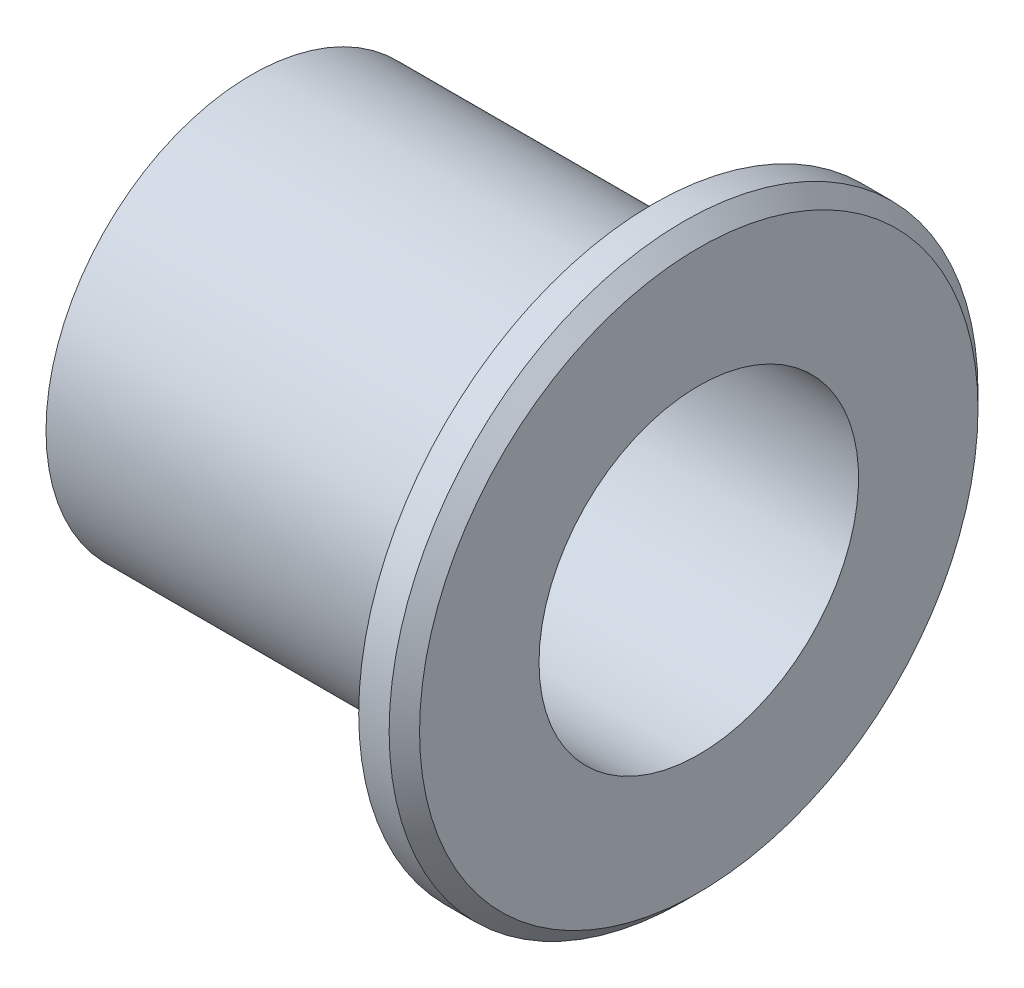
ISO-10303-21;
HEADER;
FILE_DESCRIPTION(('STEP AP214'),'2;1');
FILE_NAME('part.step','',(''),(''),'','','');
FILE_SCHEMA(('AUTOMOTIVE_DESIGN { 1 0 10303 214 1 1 1 1 }'));
ENDSEC;
DATA;
#1=APPLICATION_CONTEXT('core data for automotive mechanical design processes');
#2=APPLICATION_PROTOCOL_DEFINITION('international standard','automotive_design',2000,#1);
#3=PRODUCT_CONTEXT('',#1,'mechanical');
#4=PRODUCT('Part','Part','',(#3));
#5=PRODUCT_RELATED_PRODUCT_CATEGORY('part','',(#4));
#6=PRODUCT_DEFINITION_FORMATION('','',#4);
#7=PRODUCT_DEFINITION_CONTEXT('part definition',#1,'design');
#8=PRODUCT_DEFINITION('design','',#6,#7);
#9=PRODUCT_DEFINITION_SHAPE('','',#8);
#10=(LENGTH_UNIT() NAMED_UNIT(*) SI_UNIT(.MILLI.,.METRE.));
#11=(NAMED_UNIT(*) PLANE_ANGLE_UNIT() SI_UNIT($,.RADIAN.));
#12=(NAMED_UNIT(*) SI_UNIT($,.STERADIAN.) SOLID_ANGLE_UNIT());
#13=UNCERTAINTY_MEASURE_WITH_UNIT(LENGTH_MEASURE(1.E-05),#10,'distance_accuracy_value','');
#14=(GEOMETRIC_REPRESENTATION_CONTEXT(3) GLOBAL_UNCERTAINTY_ASSIGNED_CONTEXT((#13)) GLOBAL_UNIT_ASSIGNED_CONTEXT((#10,
#11,#12)) REPRESENTATION_CONTEXT('',''));
#15=CARTESIAN_POINT('',(0.,0.,0.));
#16=DIRECTION('',(0.,0.,1.));
#17=DIRECTION('',(1.,0.,0.));
#18=AXIS2_PLACEMENT_3D('',#15,#16,#17);
#19=CARTESIAN_POINT('',(0.,13.5,0.));
#20=DIRECTION('',(1.,0.,0.));
#21=DIRECTION('',(0.,0.,-1.));
#22=AXIS2_PLACEMENT_3D('',#19,#20,#21);
#23=PLANE('',#22);
#24=CARTESIAN_POINT('',(0.,7.,0.));
#25=DIRECTION('',(1.,0.,0.));
#26=DIRECTION('',(0.,0.,-1.));
#27=AXIS2_PLACEMENT_3D('',#24,#25,#26);
#28=CIRCLE('',#27,1.25);
#29=CARTESIAN_POINT('',(0.,7.,-1.25));
#30=VERTEX_POINT('',#29);
#31=EDGE_CURVE('E179',#30,#30,#28,.T.);
#32=ORIENTED_EDGE('',*,*,#31,.T.);
#33=EDGE_LOOP('',(#32));
#34=FACE_BOUND('',#33,.T.);
#35=CARTESIAN_POINT('',(0.,-7.,0.));
#36=DIRECTION('',(1.,0.,0.));
#37=DIRECTION('',(0.,0.,-1.));
#38=AXIS2_PLACEMENT_3D('',#35,#36,#37);
#39=CIRCLE('',#38,1.25);
#40=CARTESIAN_POINT('',(0.,-7.,-1.24999999999995));
#41=VERTEX_POINT('',#40);
#42=EDGE_CURVE('E119',#41,#41,#39,.T.);
#43=ORIENTED_EDGE('',*,*,#42,.T.);
#44=EDGE_LOOP('',(#43));
#45=FACE_BOUND('',#44,.T.);
#46=DIRECTION('',(0.,0.866025403784439,0.5));
#47=VECTOR('',#46,1.);
#48=CARTESIAN_POINT('',(0.,0.,-4.61880215351701));
#49=LINE('',#48,#47);
#50=CARTESIAN_POINT('',(0.,0.,-4.61880215351701));
#51=VERTEX_POINT('',#50);
#52=CARTESIAN_POINT('',(0.,4.,-2.3094010767585));
#53=VERTEX_POINT('',#52);
#54=EDGE_CURVE('E105',#51,#53,#49,.T.);
#55=ORIENTED_EDGE('',*,*,#54,.T.);
#56=DIRECTION('',(0.,0.,1.));
#57=VECTOR('',#56,1.);
#58=CARTESIAN_POINT('',(0.,4.,-2.3094010767585));
#59=LINE('',#58,#57);
#60=CARTESIAN_POINT('',(0.,4.,2.3094010767585));
#61=VERTEX_POINT('',#60);
#62=EDGE_CURVE('E99',#53,#61,#59,.T.);
#63=ORIENTED_EDGE('',*,*,#62,.T.);
#64=DIRECTION('',(0.,-0.866025403784439,0.5));
#65=VECTOR('',#64,1.);
#66=CARTESIAN_POINT('',(0.,4.,2.3094010767585));
#67=LINE('',#66,#65);
#68=CARTESIAN_POINT('',(0.,0.,4.618802153517));
#69=VERTEX_POINT('',#68);
#70=EDGE_CURVE('E108',#61,#69,#67,.T.);
#71=ORIENTED_EDGE('',*,*,#70,.T.);
#72=DIRECTION('',(0.,-0.866025403784439,-0.5));
#73=VECTOR('',#72,1.);
#74=CARTESIAN_POINT('',(0.,0.,4.61880215351701));
#75=LINE('',#74,#73);
#76=CARTESIAN_POINT('',(0.,-4.,2.3094010767585));
#77=VERTEX_POINT('',#76);
#78=EDGE_CURVE('E58',#69,#77,#75,.T.);
#79=ORIENTED_EDGE('',*,*,#78,.T.);
#80=DIRECTION('',(0.,0.,-1.));
#81=VECTOR('',#80,1.);
#82=CARTESIAN_POINT('',(0.,-4.,2.3094010767585));
#83=LINE('',#82,#81);
#84=CARTESIAN_POINT('',(0.,-4.,-2.3094010767585));
#85=VERTEX_POINT('',#84);
#86=EDGE_CURVE('E123',#77,#85,#83,.T.);
#87=ORIENTED_EDGE('',*,*,#86,.T.);
#88=DIRECTION('',(0.,0.866025403784439,-0.5));
#89=VECTOR('',#88,1.);
#90=CARTESIAN_POINT('',(0.,-4.,-2.3094010767585));
#91=LINE('',#90,#89);
#92=EDGE_CURVE('E126',#85,#51,#91,.T.);
#93=ORIENTED_EDGE('',*,*,#92,.T.);
#94=EDGE_LOOP('',(#55,#63,#71,#79,#87,#93));
#95=FACE_BOUND('',#94,.T.);
#96=CARTESIAN_POINT('',(0.,0.,0.));
#97=DIRECTION('',(-1.,0.,0.));
#98=DIRECTION('',(0.,0.,1.));
#99=AXIS2_PLACEMENT_3D('',#96,#97,#98);
#100=CIRCLE('',#99,13.5);
#101=CARTESIAN_POINT('',(0.,0.,13.5));
#102=VERTEX_POINT('',#101);
#103=EDGE_CURVE('E159',#102,#102,#100,.T.);
#104=ORIENTED_EDGE('',*,*,#103,.T.);
#105=EDGE_LOOP('',(#104));
#106=FACE_BOUND('',#105,.T.);
#107=ADVANCED_FACE('F40',(#34,#45,#95,#106),#23,.F.);
#108=CARTESIAN_POINT('',(0.,0.,0.));
#109=DIRECTION('',(-1.,0.,0.));
#110=DIRECTION('',(0.,0.,1.));
#111=AXIS2_PLACEMENT_3D('',#108,#109,#110);
#112=CYLINDRICAL_SURFACE('',#111,13.5);
#113=ORIENTED_EDGE('',*,*,#103,.F.);
#114=EDGE_LOOP('',(#113));
#115=FACE_BOUND('',#114,.T.);
#116=CARTESIAN_POINT('',(24.5,0.,0.));
#117=DIRECTION('',(-1.,0.,0.));
#118=DIRECTION('',(0.,0.,1.));
#119=AXIS2_PLACEMENT_3D('',#116,#117,#118);
#120=CIRCLE('',#119,13.5);
#121=CARTESIAN_POINT('',(24.5,0.,13.5));
#122=VERTEX_POINT('',#121);
#123=EDGE_CURVE('E156',#122,#122,#120,.T.);
#124=ORIENTED_EDGE('',*,*,#123,.T.);
#125=EDGE_LOOP('',(#124));
#126=FACE_BOUND('',#125,.T.);
#127=ADVANCED_FACE('F203',(#115,#126),#112,.T.);
#128=CARTESIAN_POINT('',(24.5,12.5,0.));
#129=DIRECTION('',(-1.,0.,0.));
#130=DIRECTION('',(0.,0.,1.));
#131=AXIS2_PLACEMENT_3D('',#128,#129,#130);
#132=PLANE('',#131);
#133=ORIENTED_EDGE('',*,*,#123,.F.);
#134=EDGE_LOOP('',(#133));
#135=FACE_BOUND('',#134,.T.);
#136=CARTESIAN_POINT('',(24.5,0.,0.));
#137=DIRECTION('',(-1.,0.,0.));
#138=DIRECTION('',(0.,0.,1.));
#139=AXIS2_PLACEMENT_3D('',#136,#137,#138);
#140=CIRCLE('',#139,12.5);
#141=CARTESIAN_POINT('',(24.5,0.,12.5));
#142=VERTEX_POINT('',#141);
#143=EDGE_CURVE('E153',#142,#142,#140,.T.);
#144=ORIENTED_EDGE('',*,*,#143,.T.);
#145=EDGE_LOOP('',(#144));
#146=FACE_BOUND('',#145,.T.);
#147=ADVANCED_FACE('F207',(#135,#146),#132,.F.);
#148=CARTESIAN_POINT('',(0.,0.,0.));
#149=DIRECTION('',(-1.,0.,0.));
#150=DIRECTION('',(0.,0.,1.));
#151=AXIS2_PLACEMENT_3D('',#148,#149,#150);
#152=CYLINDRICAL_SURFACE('',#151,12.5);
#153=ORIENTED_EDGE('',*,*,#143,.F.);
#154=EDGE_LOOP('',(#153));
#155=FACE_BOUND('',#154,.T.);
#156=CARTESIAN_POINT('',(26.4,0.,0.));
#157=DIRECTION('',(-1.,0.,0.));
#158=DIRECTION('',(0.,0.,1.));
#159=AXIS2_PLACEMENT_3D('',#156,#157,#158);
#160=CIRCLE('',#159,12.5);
#161=CARTESIAN_POINT('',(26.4,0.,12.5));
#162=VERTEX_POINT('',#161);
#163=EDGE_CURVE('E150',#162,#162,#160,.T.);
#164=ORIENTED_EDGE('',*,*,#163,.T.);
#165=EDGE_LOOP('',(#164));
#166=FACE_BOUND('',#165,.T.);
#167=ADVANCED_FACE('F213',(#155,#166),#152,.T.);
#168=CARTESIAN_POINT('',(26.4,19.35,0.));
#169=DIRECTION('',(1.,0.,0.));
#170=DIRECTION('',(0.,0.,-1.));
#171=AXIS2_PLACEMENT_3D('',#168,#169,#170);
#172=PLANE('',#171);
#173=ORIENTED_EDGE('',*,*,#163,.F.);
#174=EDGE_LOOP('',(#173));
#175=FACE_BOUND('',#174,.T.);
#176=CARTESIAN_POINT('',(26.4,0.,0.));
#177=DIRECTION('',(-1.,0.,0.));
#178=DIRECTION('',(0.,0.,1.));
#179=AXIS2_PLACEMENT_3D('',#176,#177,#178);
#180=CIRCLE('',#179,19.35);
#181=CARTESIAN_POINT('',(26.4,0.,19.35));
#182=VERTEX_POINT('',#181);
#183=EDGE_CURVE('E147',#182,#182,#180,.T.);
#184=ORIENTED_EDGE('',*,*,#183,.T.);
#185=EDGE_LOOP('',(#184));
#186=FACE_BOUND('',#185,.T.);
#187=ADVANCED_FACE('F217',(#175,#186),#172,.F.);
#188=CARTESIAN_POINT('',(0.,0.,0.));
#189=DIRECTION('',(-1.,0.,0.));
#190=DIRECTION('',(0.,0.,1.));
#191=AXIS2_PLACEMENT_3D('',#188,#189,#190);
#192=CYLINDRICAL_SURFACE('',#191,19.35);
#193=CARTESIAN_POINT('',(28.4,0.,0.));
#194=DIRECTION('',(-1.,0.,0.));
#195=DIRECTION('',(0.,0.,1.));
#196=AXIS2_PLACEMENT_3D('',#193,#194,#195);
#197=CIRCLE('',#196,19.35);
#198=CARTESIAN_POINT('',(28.4,0.,19.35));
#199=VERTEX_POINT('',#198);
#200=EDGE_CURVE('E50',#199,#199,#197,.T.);
#201=ORIENTED_EDGE('',*,*,#200,.T.);
#202=EDGE_LOOP('',(#201));
#203=FACE_BOUND('',#202,.T.);
#204=ORIENTED_EDGE('',*,*,#183,.F.);
#205=EDGE_LOOP('',(#204));
#206=FACE_BOUND('',#205,.T.);
#207=ADVANCED_FACE('F221',(#203,#206),#192,.T.);
#208=CARTESIAN_POINT('',(29.4,19.35,0.));
#209=DIRECTION('',(-1.,0.,0.));
#210=DIRECTION('',(0.,0.,1.));
#211=AXIS2_PLACEMENT_3D('',#208,#209,#210);
#212=PLANE('',#211);
#213=CARTESIAN_POINT('',(29.4,0.,0.));
#214=DIRECTION('',(-1.,0.,0.));
#215=DIRECTION('',(0.,0.,1.));
#216=AXIS2_PLACEMENT_3D('',#213,#214,#215);
#217=CIRCLE('',#216,18.35);
#218=CARTESIAN_POINT('',(29.4,0.,18.35));
#219=VERTEX_POINT('',#218);
#220=EDGE_CURVE('E11',#219,#219,#217,.F.);
#221=ORIENTED_EDGE('',*,*,#220,.T.);
#222=EDGE_LOOP('',(#221));
#223=FACE_BOUND('',#222,.T.);
#224=CARTESIAN_POINT('',(29.4,0.,0.));
#225=DIRECTION('',(-1.,0.,0.));
#226=DIRECTION('',(0.,0.,1.));
#227=AXIS2_PLACEMENT_3D('',#224,#225,#226);
#228=CIRCLE('',#227,10.5);
#229=CARTESIAN_POINT('',(29.4,0.,10.5));
#230=VERTEX_POINT('',#229);
#231=EDGE_CURVE('E144',#230,#230,#228,.T.);
#232=ORIENTED_EDGE('',*,*,#231,.T.);
#233=EDGE_LOOP('',(#232));
#234=FACE_BOUND('',#233,.T.);
#235=ADVANCED_FACE('F225',(#223,#234),#212,.F.);
#236=CARTESIAN_POINT('',(0.,0.,0.));
#237=DIRECTION('',(-1.,0.,0.));
#238=DIRECTION('',(0.,0.,1.));
#239=AXIS2_PLACEMENT_3D('',#236,#237,#238);
#240=CYLINDRICAL_SURFACE('',#239,10.5);
#241=ORIENTED_EDGE('',*,*,#231,.F.);
#242=EDGE_LOOP('',(#241));
#243=FACE_BOUND('',#242,.T.);
#244=CARTESIAN_POINT('',(8.,0.,0.));
#245=DIRECTION('',(-1.,0.,0.));
#246=DIRECTION('',(0.,0.,1.));
#247=AXIS2_PLACEMENT_3D('',#244,#245,#246);
#248=CIRCLE('',#247,10.5);
#249=CARTESIAN_POINT('',(8.,0.,10.5));
#250=VERTEX_POINT('',#249);
#251=EDGE_CURVE('E131',#250,#250,#248,.T.);
#252=ORIENTED_EDGE('',*,*,#251,.T.);
#253=EDGE_LOOP('',(#252));
#254=FACE_BOUND('',#253,.T.);
#255=ADVANCED_FACE('F229',(#243,#254),#240,.F.);
#256=CARTESIAN_POINT('',(8.,10.5,0.));
#257=DIRECTION('',(-1.,0.,0.));
#258=DIRECTION('',(0.,0.,1.));
#259=AXIS2_PLACEMENT_3D('',#256,#257,#258);
#260=PLANE('',#259);
#261=CARTESIAN_POINT('',(8.,7.,0.));
#262=DIRECTION('',(-1.,0.,0.));
#263=DIRECTION('',(0.,0.,1.));
#264=AXIS2_PLACEMENT_3D('',#261,#262,#263);
#265=CIRCLE('',#264,1.25);
#266=CARTESIAN_POINT('',(8.,7.,1.25));
#267=VERTEX_POINT('',#266);
#268=EDGE_CURVE('E45',#267,#267,#265,.T.);
#269=ORIENTED_EDGE('',*,*,#268,.T.);
#270=EDGE_LOOP('',(#269));
#271=FACE_BOUND('',#270,.T.);
#272=CARTESIAN_POINT('',(8.,-7.,0.));
#273=DIRECTION('',(-1.,0.,0.));
#274=DIRECTION('',(0.,0.,1.));
#275=AXIS2_PLACEMENT_3D('',#272,#273,#274);
#276=CIRCLE('',#275,1.25);
#277=CARTESIAN_POINT('',(8.,-7.,1.25000000000005));
#278=VERTEX_POINT('',#277);
#279=EDGE_CURVE('E117',#278,#278,#276,.T.);
#280=ORIENTED_EDGE('',*,*,#279,.T.);
#281=EDGE_LOOP('',(#280));
#282=FACE_BOUND('',#281,.T.);
#283=DIRECTION('',(0.,0.866025403784439,-0.5));
#284=VECTOR('',#283,1.);
#285=CARTESIAN_POINT('',(8.,9.87500000000001,-1.08253175473055));
#286=LINE('',#285,#284);
#287=CARTESIAN_POINT('',(8.,0.,4.61880215351701));
#288=VERTEX_POINT('',#287);
#289=CARTESIAN_POINT('',(8.,4.,2.3094010767585));
#290=VERTEX_POINT('',#289);
#291=EDGE_CURVE('E162',#288,#290,#286,.T.);
#292=ORIENTED_EDGE('',*,*,#291,.T.);
#293=DIRECTION('',(0.,0.,-1.));
#294=VECTOR('',#293,1.);
#295=CARTESIAN_POINT('',(8.,4.,0.));
#296=LINE('',#295,#294);
#297=CARTESIAN_POINT('',(8.,4.,-2.3094010767585));
#298=VERTEX_POINT('',#297);
#299=EDGE_CURVE('E102',#290,#298,#296,.T.);
#300=ORIENTED_EDGE('',*,*,#299,.T.);
#301=DIRECTION('',(0.,-0.866025403784439,-0.5));
#302=VECTOR('',#301,1.);
#303=CARTESIAN_POINT('',(8.,9.87500000000001,1.08253175473055));
#304=LINE('',#303,#302);
#305=CARTESIAN_POINT('',(8.,0.,-4.61880215351701));
#306=VERTEX_POINT('',#305);
#307=EDGE_CURVE('E173',#298,#306,#304,.T.);
#308=ORIENTED_EDGE('',*,*,#307,.T.);
#309=DIRECTION('',(0.,-0.866025403784439,0.5));
#310=VECTOR('',#309,1.);
#311=CARTESIAN_POINT('',(8.,5.875,-8.01073498500606));
#312=LINE('',#311,#310);
#313=CARTESIAN_POINT('',(8.,-4.,-2.3094010767585));
#314=VERTEX_POINT('',#313);
#315=EDGE_CURVE('E170',#306,#314,#312,.T.);
#316=ORIENTED_EDGE('',*,*,#315,.T.);
#317=DIRECTION('',(0.,0.,1.));
#318=VECTOR('',#317,1.);
#319=CARTESIAN_POINT('',(8.,-4.,0.));
#320=LINE('',#319,#318);
#321=CARTESIAN_POINT('',(8.,-4.,2.3094010767585));
#322=VERTEX_POINT('',#321);
#323=EDGE_CURVE('E167',#314,#322,#320,.T.);
#324=ORIENTED_EDGE('',*,*,#323,.T.);
#325=DIRECTION('',(0.,0.866025403784439,0.5));
#326=VECTOR('',#325,1.);
#327=CARTESIAN_POINT('',(8.,5.87500000000001,8.01073498500606));
#328=LINE('',#327,#326);
#329=EDGE_CURVE('E164',#322,#288,#328,.T.);
#330=ORIENTED_EDGE('',*,*,#329,.T.);
#331=EDGE_LOOP('',(#292,#300,#308,#316,#324,#330));
#332=FACE_BOUND('',#331,.T.);
#333=ORIENTED_EDGE('',*,*,#251,.F.);
#334=EDGE_LOOP('',(#333));
#335=FACE_BOUND('',#334,.T.);
#336=ADVANCED_FACE('F233',(#271,#282,#332,#335),#260,.F.);
#337=CARTESIAN_POINT('',(0.,4.,-2.3094010767585));
#338=DIRECTION('',(0.,1.,0.));
#339=DIRECTION('',(0.,0.,1.));
#340=AXIS2_PLACEMENT_3D('',#337,#338,#339);
#341=PLANE('',#340);
#342=DIRECTION('',(1.,0.,0.));
#343=VECTOR('',#342,1.);
#344=CARTESIAN_POINT('',(0.,4.,2.3094010767585));
#345=LINE('',#344,#343);
#346=EDGE_CURVE('E66',#61,#290,#345,.T.);
#347=ORIENTED_EDGE('',*,*,#346,.F.);
#348=ORIENTED_EDGE('',*,*,#62,.F.);
#349=DIRECTION('',(1.,0.,0.));
#350=VECTOR('',#349,1.);
#351=CARTESIAN_POINT('',(0.,4.,-2.3094010767585));
#352=LINE('',#351,#350);
#353=EDGE_CURVE('E129',#53,#298,#352,.T.);
#354=ORIENTED_EDGE('',*,*,#353,.T.);
#355=ORIENTED_EDGE('',*,*,#299,.F.);
#356=EDGE_LOOP('',(#347,#348,#354,#355));
#357=FACE_BOUND('',#356,.T.);
#358=ADVANCED_FACE('F96',(#357),#341,.F.);
#359=CARTESIAN_POINT('',(0.,0.,-4.61880215351701));
#360=DIRECTION('',(0.,0.5,-0.866025403784439));
#361=DIRECTION('',(0.,0.866025403784439,0.5));
#362=AXIS2_PLACEMENT_3D('',#359,#360,#361);
#363=PLANE('',#362);
#364=ORIENTED_EDGE('',*,*,#353,.F.);
#365=ORIENTED_EDGE('',*,*,#54,.F.);
#366=DIRECTION('',(1.,0.,0.));
#367=VECTOR('',#366,1.);
#368=CARTESIAN_POINT('',(0.,0.,-4.61880215351701));
#369=LINE('',#368,#367);
#370=EDGE_CURVE('E132',#51,#306,#369,.T.);
#371=ORIENTED_EDGE('',*,*,#370,.T.);
#372=ORIENTED_EDGE('',*,*,#307,.F.);
#373=EDGE_LOOP('',(#364,#365,#371,#372));
#374=FACE_BOUND('',#373,.T.);
#375=ADVANCED_FACE('F240',(#374),#363,.F.);
#376=CARTESIAN_POINT('',(0.,-4.,-2.3094010767585));
#377=DIRECTION('',(0.,-0.5,-0.866025403784439));
#378=DIRECTION('',(0.,0.866025403784439,-0.5));
#379=AXIS2_PLACEMENT_3D('',#376,#377,#378);
#380=PLANE('',#379);
#381=ORIENTED_EDGE('',*,*,#370,.F.);
#382=ORIENTED_EDGE('',*,*,#92,.F.);
#383=DIRECTION('',(1.,0.,0.));
#384=VECTOR('',#383,1.);
#385=CARTESIAN_POINT('',(0.,-4.,-2.3094010767585));
#386=LINE('',#385,#384);
#387=EDGE_CURVE('E135',#85,#314,#386,.T.);
#388=ORIENTED_EDGE('',*,*,#387,.T.);
#389=ORIENTED_EDGE('',*,*,#315,.F.);
#390=EDGE_LOOP('',(#381,#382,#388,#389));
#391=FACE_BOUND('',#390,.T.);
#392=ADVANCED_FACE('F249',(#391),#380,.F.);
#393=CARTESIAN_POINT('',(0.,-4.,2.3094010767585));
#394=DIRECTION('',(0.,-1.,0.));
#395=DIRECTION('',(0.,0.,-1.));
#396=AXIS2_PLACEMENT_3D('',#393,#394,#395);
#397=PLANE('',#396);
#398=ORIENTED_EDGE('',*,*,#387,.F.);
#399=ORIENTED_EDGE('',*,*,#86,.F.);
#400=DIRECTION('',(1.,0.,0.));
#401=VECTOR('',#400,1.);
#402=CARTESIAN_POINT('',(0.,-4.,2.3094010767585));
#403=LINE('',#402,#401);
#404=EDGE_CURVE('E138',#77,#322,#403,.T.);
#405=ORIENTED_EDGE('',*,*,#404,.T.);
#406=ORIENTED_EDGE('',*,*,#323,.F.);
#407=EDGE_LOOP('',(#398,#399,#405,#406));
#408=FACE_BOUND('',#407,.T.);
#409=ADVANCED_FACE('F246',(#408),#397,.F.);
#410=CARTESIAN_POINT('',(0.,0.,4.61880215351701));
#411=DIRECTION('',(0.,-0.5,0.866025403784439));
#412=DIRECTION('',(0.,-0.866025403784439,-0.5));
#413=AXIS2_PLACEMENT_3D('',#410,#411,#412);
#414=PLANE('',#413);
#415=ORIENTED_EDGE('',*,*,#404,.F.);
#416=ORIENTED_EDGE('',*,*,#78,.F.);
#417=DIRECTION('',(1.,0.,0.));
#418=VECTOR('',#417,1.);
#419=CARTESIAN_POINT('',(0.,0.,4.61880215351701));
#420=LINE('',#419,#418);
#421=EDGE_CURVE('E104',#69,#288,#420,.T.);
#422=ORIENTED_EDGE('',*,*,#421,.T.);
#423=ORIENTED_EDGE('',*,*,#329,.F.);
#424=EDGE_LOOP('',(#415,#416,#422,#423));
#425=FACE_BOUND('',#424,.T.);
#426=ADVANCED_FACE('F243',(#425),#414,.F.);
#427=CARTESIAN_POINT('',(0.,4.,2.3094010767585));
#428=DIRECTION('',(0.,0.5,0.866025403784439));
#429=DIRECTION('',(0.,-0.866025403784439,0.5));
#430=AXIS2_PLACEMENT_3D('',#427,#428,#429);
#431=PLANE('',#430);
#432=ORIENTED_EDGE('',*,*,#421,.F.);
#433=ORIENTED_EDGE('',*,*,#70,.F.);
#434=ORIENTED_EDGE('',*,*,#346,.T.);
#435=ORIENTED_EDGE('',*,*,#291,.F.);
#436=EDGE_LOOP('',(#432,#433,#434,#435));
#437=FACE_BOUND('',#436,.T.);
#438=ADVANCED_FACE('F109',(#437),#431,.F.);
#439=CARTESIAN_POINT('',(28.4,0.,0.));
#440=DIRECTION('',(-1.,0.,0.));
#441=DIRECTION('',(0.,0.,1.));
#442=AXIS2_PLACEMENT_3D('',#439,#440,#441);
#443=CONICAL_SURFACE('',#442,19.35,0.78539816339745);
#444=ORIENTED_EDGE('',*,*,#220,.F.);
#445=EDGE_LOOP('',(#444));
#446=FACE_BOUND('',#445,.T.);
#447=ORIENTED_EDGE('',*,*,#200,.F.);
#448=EDGE_LOOP('',(#447));
#449=FACE_BOUND('',#448,.T.);
#450=ADVANCED_FACE('F43',(#446,#449),#443,.T.);
#451=CARTESIAN_POINT('',(0.,-7.,0.));
#452=DIRECTION('',(1.,0.,0.));
#453=DIRECTION('',(0.,0.,-1.));
#454=AXIS2_PLACEMENT_3D('',#451,#452,#453);
#455=CYLINDRICAL_SURFACE('',#454,1.25);
#456=ORIENTED_EDGE('',*,*,#42,.F.);
#457=EDGE_LOOP('',(#456));
#458=FACE_BOUND('',#457,.T.);
#459=ORIENTED_EDGE('',*,*,#279,.F.);
#460=EDGE_LOOP('',(#459));
#461=FACE_BOUND('',#460,.T.);
#462=ADVANCED_FACE('F189',(#458,#461),#455,.F.);
#463=CARTESIAN_POINT('',(0.,7.,0.));
#464=DIRECTION('',(1.,0.,0.));
#465=DIRECTION('',(0.,0.,-1.));
#466=AXIS2_PLACEMENT_3D('',#463,#464,#465);
#467=CYLINDRICAL_SURFACE('',#466,1.25);
#468=ORIENTED_EDGE('',*,*,#31,.F.);
#469=EDGE_LOOP('',(#468));
#470=FACE_BOUND('',#469,.T.);
#471=ORIENTED_EDGE('',*,*,#268,.F.);
#472=EDGE_LOOP('',(#471));
#473=FACE_BOUND('',#472,.T.);
#474=ADVANCED_FACE('F192',(#470,#473),#467,.F.);
#475=CLOSED_SHELL('',(#107,#127,#147,#167,#187,#207,#235,#255,#336,#358,#375,#392,#409,#426,
#438,#450,#462,#474));
#476=MANIFOLD_SOLID_BREP('B2',#475);
#477=ADVANCED_BREP_SHAPE_REPRESENTATION('',(#18,#476),#14);
#478=SHAPE_DEFINITION_REPRESENTATION(#9,#477);
ENDSEC;
END-ISO-10303-21;
